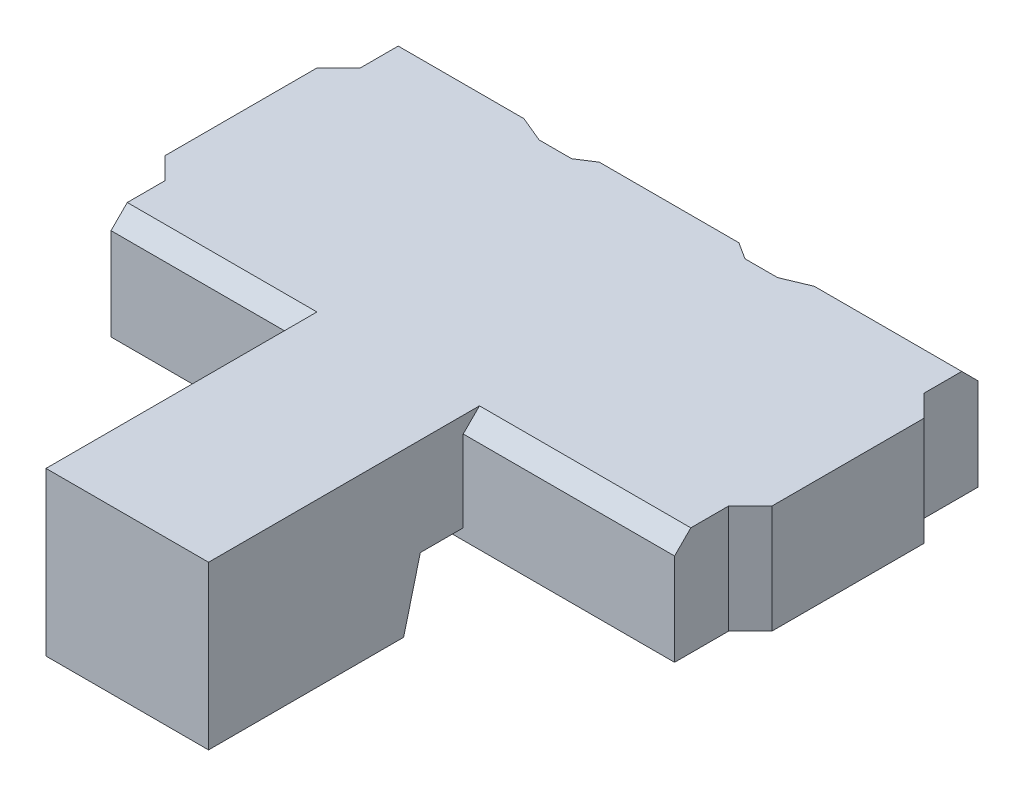
ISO-10303-21;
HEADER;
FILE_DESCRIPTION(('STEP AP214'),'2;1');
FILE_NAME('part.step','',(''),(''),'','','');
FILE_SCHEMA(('AUTOMOTIVE_DESIGN { 1 0 10303 214 1 1 1 1 }'));
ENDSEC;
DATA;
#1=APPLICATION_CONTEXT('core data for automotive mechanical design processes');
#2=APPLICATION_PROTOCOL_DEFINITION('international standard','automotive_design',2000,#1);
#3=PRODUCT_CONTEXT('',#1,'mechanical');
#4=PRODUCT('Part','Part','',(#3));
#5=PRODUCT_RELATED_PRODUCT_CATEGORY('part','',(#4));
#6=PRODUCT_DEFINITION_FORMATION('','',#4);
#7=PRODUCT_DEFINITION_CONTEXT('part definition',#1,'design');
#8=PRODUCT_DEFINITION('design','',#6,#7);
#9=PRODUCT_DEFINITION_SHAPE('','',#8);
#10=(LENGTH_UNIT() NAMED_UNIT(*) SI_UNIT(.MILLI.,.METRE.));
#11=(NAMED_UNIT(*) PLANE_ANGLE_UNIT() SI_UNIT($,.RADIAN.));
#12=(NAMED_UNIT(*) SI_UNIT($,.STERADIAN.) SOLID_ANGLE_UNIT());
#13=UNCERTAINTY_MEASURE_WITH_UNIT(LENGTH_MEASURE(1.E-05),#10,'distance_accuracy_value','');
#14=(GEOMETRIC_REPRESENTATION_CONTEXT(3) GLOBAL_UNCERTAINTY_ASSIGNED_CONTEXT((#13)) GLOBAL_UNIT_ASSIGNED_CONTEXT((#10,
#11,#12)) REPRESENTATION_CONTEXT('',''));
#15=CARTESIAN_POINT('',(0.,0.,0.));
#16=DIRECTION('',(0.,0.,1.));
#17=DIRECTION('',(1.,0.,0.));
#18=AXIS2_PLACEMENT_3D('',#15,#16,#17);
#19=CARTESIAN_POINT('',(-0.25,0.,0.));
#20=DIRECTION('',(1.,0.,0.));
#21=DIRECTION('',(0.,1.,0.));
#22=AXIS2_PLACEMENT_3D('',#19,#20,#21);
#23=PLANE('',#22);
#24=DIRECTION('',(0.,0.,-1.));
#25=VECTOR('',#24,1.);
#26=CARTESIAN_POINT('',(-0.25,-0.9,1.795946183779));
#27=LINE('',#26,#25);
#28=CARTESIAN_POINT('',(-0.25,-0.9,1.795946183779));
#29=VERTEX_POINT('',#28);
#30=CARTESIAN_POINT('',(-0.25,-0.9,1.4));
#31=VERTEX_POINT('',#30);
#32=EDGE_CURVE('E439',#29,#31,#27,.T.);
#33=ORIENTED_EDGE('',*,*,#32,.T.);
#34=DIRECTION('',(0.,1.,0.));
#35=VECTOR('',#34,1.);
#36=CARTESIAN_POINT('',(-0.25,-1.,1.4));
#37=LINE('',#36,#35);
#38=CARTESIAN_POINT('',(-0.25,-0.15,1.4));
#39=VERTEX_POINT('',#38);
#40=EDGE_CURVE('E395',#31,#39,#37,.T.);
#41=ORIENTED_EDGE('',*,*,#40,.T.);
#42=DIRECTION('',(0.,-0.707106781186548,0.707106781186548));
#43=VECTOR('',#42,1.);
#44=CARTESIAN_POINT('',(-0.25,0.,1.25));
#45=LINE('',#44,#43);
#46=CARTESIAN_POINT('',(-0.25,0.,1.25));
#47=VERTEX_POINT('',#46);
#48=EDGE_CURVE('E422',#47,#39,#45,.T.);
#49=ORIENTED_EDGE('',*,*,#48,.F.);
#50=DIRECTION('',(0.,0.,1.));
#51=VECTOR('',#50,1.);
#52=CARTESIAN_POINT('',(-0.25,0.,0.9));
#53=LINE('',#52,#51);
#54=CARTESIAN_POINT('',(-0.25,0.,3.75));
#55=VERTEX_POINT('',#54);
#56=EDGE_CURVE('E527',#47,#55,#53,.T.);
#57=ORIENTED_EDGE('',*,*,#56,.T.);
#58=DIRECTION('',(0.,-1.,0.));
#59=VECTOR('',#58,1.);
#60=CARTESIAN_POINT('',(-0.25,0.,3.75));
#61=LINE('',#60,#59);
#62=CARTESIAN_POINT('',(-0.25,-1.5,3.75));
#63=VERTEX_POINT('',#62);
#64=EDGE_CURVE('E328',#55,#63,#61,.T.);
#65=ORIENTED_EDGE('',*,*,#64,.T.);
#66=DIRECTION('',(0.,0.,-1.));
#67=VECTOR('',#66,1.);
#68=CARTESIAN_POINT('',(-0.25,-1.5,3.75));
#69=LINE('',#68,#67);
#70=CARTESIAN_POINT('',(-0.25,-1.5,1.95));
#71=VERTEX_POINT('',#70);
#72=EDGE_CURVE('E505',#63,#71,#69,.T.);
#73=ORIENTED_EDGE('',*,*,#72,.T.);
#74=DIRECTION('',(0.,0.968583161128619,-0.248689887164902));
#75=VECTOR('',#74,1.);
#76=CARTESIAN_POINT('',(-0.25,-1.5,1.95));
#77=LINE('',#76,#75);
#78=EDGE_CURVE('E317',#71,#29,#77,.T.);
#79=ORIENTED_EDGE('',*,*,#78,.T.);
#80=EDGE_LOOP('',(#33,#41,#49,#57,#65,#73,#79));
#81=FACE_BOUND('',#80,.T.);
#82=ADVANCED_FACE('F16',(#81),#23,.T.);
#83=CARTESIAN_POINT('',(-1.75,0.,0.));
#84=DIRECTION('',(1.,0.,0.));
#85=DIRECTION('',(0.,1.,0.));
#86=AXIS2_PLACEMENT_3D('',#83,#84,#85);
#87=PLANE('',#86);
#88=DIRECTION('',(0.,1.,0.));
#89=VECTOR('',#88,1.);
#90=CARTESIAN_POINT('',(-1.75,-1.,1.4));
#91=LINE('',#90,#89);
#92=CARTESIAN_POINT('',(-1.75,-0.9,1.4));
#93=VERTEX_POINT('',#92);
#94=CARTESIAN_POINT('',(-1.75,-0.15,1.4));
#95=VERTEX_POINT('',#94);
#96=EDGE_CURVE('E392',#93,#95,#91,.T.);
#97=ORIENTED_EDGE('',*,*,#96,.F.);
#98=DIRECTION('',(0.,0.,-1.));
#99=VECTOR('',#98,1.);
#100=CARTESIAN_POINT('',(-1.75,-0.9,1.795946183779));
#101=LINE('',#100,#99);
#102=CARTESIAN_POINT('',(-1.75,-0.9,1.795946183779));
#103=VERTEX_POINT('',#102);
#104=EDGE_CURVE('E434',#103,#93,#101,.T.);
#105=ORIENTED_EDGE('',*,*,#104,.F.);
#106=DIRECTION('',(0.,0.968583161128619,-0.248689887164902));
#107=VECTOR('',#106,1.);
#108=CARTESIAN_POINT('',(-1.75,-1.5,1.95));
#109=LINE('',#108,#107);
#110=CARTESIAN_POINT('',(-1.75,-1.5,1.95));
#111=VERTEX_POINT('',#110);
#112=EDGE_CURVE('E578',#111,#103,#109,.T.);
#113=ORIENTED_EDGE('',*,*,#112,.F.);
#114=DIRECTION('',(0.,0.,-1.));
#115=VECTOR('',#114,1.);
#116=CARTESIAN_POINT('',(-1.75,-1.5,3.75));
#117=LINE('',#116,#115);
#118=CARTESIAN_POINT('',(-1.75,-1.5,3.75));
#119=VERTEX_POINT('',#118);
#120=EDGE_CURVE('E438',#119,#111,#117,.T.);
#121=ORIENTED_EDGE('',*,*,#120,.F.);
#122=DIRECTION('',(0.,-1.,0.));
#123=VECTOR('',#122,1.);
#124=CARTESIAN_POINT('',(-1.75,0.,3.75));
#125=LINE('',#124,#123);
#126=CARTESIAN_POINT('',(-1.75,0.,3.75));
#127=VERTEX_POINT('',#126);
#128=EDGE_CURVE('E324',#127,#119,#125,.T.);
#129=ORIENTED_EDGE('',*,*,#128,.F.);
#130=DIRECTION('',(0.,0.,1.));
#131=VECTOR('',#130,1.);
#132=CARTESIAN_POINT('',(-1.75,0.,0.9));
#133=LINE('',#132,#131);
#134=CARTESIAN_POINT('',(-1.75,0.,1.25));
#135=VERTEX_POINT('',#134);
#136=EDGE_CURVE('E330',#135,#127,#133,.T.);
#137=ORIENTED_EDGE('',*,*,#136,.F.);
#138=DIRECTION('',(0.,-0.707106781186548,0.707106781186548));
#139=VECTOR('',#138,1.);
#140=CARTESIAN_POINT('',(-1.75,0.,1.25));
#141=LINE('',#140,#139);
#142=EDGE_CURVE('E485',#135,#95,#141,.T.);
#143=ORIENTED_EDGE('',*,*,#142,.T.);
#144=EDGE_LOOP('',(#97,#105,#113,#121,#129,#137,#143));
#145=FACE_BOUND('',#144,.T.);
#146=ADVANCED_FACE('F695',(#145),#87,.F.);
#147=CARTESIAN_POINT('',(1.9,-1.,-0.7));
#148=DIRECTION('',(0.707106781186548,0.,-0.707106781186548));
#149=DIRECTION('',(0.,-1.,0.));
#150=AXIS2_PLACEMENT_3D('',#147,#148,#149);
#151=PLANE('',#150);
#152=DIRECTION('',(-0.707106781186548,0.,-0.707106781186548));
#153=VECTOR('',#152,1.);
#154=CARTESIAN_POINT('',(1.9,0.,-0.7));
#155=LINE('',#154,#153);
#156=CARTESIAN_POINT('',(1.9,0.,-0.7));
#157=VERTEX_POINT('',#156);
#158=CARTESIAN_POINT('',(1.7,0.,-0.9));
#159=VERTEX_POINT('',#158);
#160=EDGE_CURVE('E306',#157,#159,#155,.T.);
#161=ORIENTED_EDGE('',*,*,#160,.F.);
#162=DIRECTION('',(0.,1.,0.));
#163=VECTOR('',#162,1.);
#164=CARTESIAN_POINT('',(1.9,-1.,-0.7));
#165=LINE('',#164,#163);
#166=CARTESIAN_POINT('',(1.9,-1.,-0.7));
#167=VERTEX_POINT('',#166);
#168=EDGE_CURVE('E445',#167,#157,#165,.T.);
#169=ORIENTED_EDGE('',*,*,#168,.F.);
#170=DIRECTION('',(-0.707106781186548,0.,-0.707106781186548));
#171=VECTOR('',#170,1.);
#172=CARTESIAN_POINT('',(1.9,-1.,-0.7));
#173=LINE('',#172,#171);
#174=CARTESIAN_POINT('',(1.7,-1.,-0.9));
#175=VERTEX_POINT('',#174);
#176=EDGE_CURVE('E426',#167,#175,#173,.T.);
#177=ORIENTED_EDGE('',*,*,#176,.T.);
#178=DIRECTION('',(0.,1.,0.));
#179=VECTOR('',#178,1.);
#180=CARTESIAN_POINT('',(1.7,-1.,-0.9));
#181=LINE('',#180,#179);
#182=EDGE_CURVE('E11',#175,#159,#181,.T.);
#183=ORIENTED_EDGE('',*,*,#182,.T.);
#184=EDGE_LOOP('',(#161,#169,#177,#183));
#185=FACE_BOUND('',#184,.T.);
#186=ADVANCED_FACE('F1129',(#185),#151,.T.);
#187=CARTESIAN_POINT('',(1.7,-1.,-0.9));
#188=DIRECTION('',(1.,0.,0.));
#189=DIRECTION('',(0.,1.,0.));
#190=AXIS2_PLACEMENT_3D('',#187,#188,#189);
#191=PLANE('',#190);
#192=DIRECTION('',(0.,-0.707106781186548,-0.707106781186548));
#193=VECTOR('',#192,1.);
#194=CARTESIAN_POINT('',(1.7,-0.325,-1.575));
#195=LINE('',#194,#193);
#196=CARTESIAN_POINT('',(1.7,0.,-1.25));
#197=VERTEX_POINT('',#196);
#198=CARTESIAN_POINT('',(1.7,-0.15,-1.4));
#199=VERTEX_POINT('',#198);
#200=EDGE_CURVE('E352',#197,#199,#195,.T.);
#201=ORIENTED_EDGE('',*,*,#200,.F.);
#202=DIRECTION('',(0.,0.,-1.));
#203=VECTOR('',#202,1.);
#204=CARTESIAN_POINT('',(1.7,0.,-0.9));
#205=LINE('',#204,#203);
#206=EDGE_CURVE('E300',#159,#197,#205,.T.);
#207=ORIENTED_EDGE('',*,*,#206,.F.);
#208=ORIENTED_EDGE('',*,*,#182,.F.);
#209=DIRECTION('',(0.,0.,-1.));
#210=VECTOR('',#209,1.);
#211=CARTESIAN_POINT('',(1.7,-1.,-0.9));
#212=LINE('',#211,#210);
#213=CARTESIAN_POINT('',(1.7,-1.,-1.4));
#214=VERTEX_POINT('',#213);
#215=EDGE_CURVE('E377',#175,#214,#212,.T.);
#216=ORIENTED_EDGE('',*,*,#215,.T.);
#217=DIRECTION('',(0.,1.,0.));
#218=VECTOR('',#217,1.);
#219=CARTESIAN_POINT('',(1.7,-1.,-1.4));
#220=LINE('',#219,#218);
#221=EDGE_CURVE('E27',#214,#199,#220,.T.);
#222=ORIENTED_EDGE('',*,*,#221,.T.);
#223=EDGE_LOOP('',(#201,#207,#208,#216,#222));
#224=FACE_BOUND('',#223,.T.);
#225=ADVANCED_FACE('F1124',(#224),#191,.T.);
#226=CARTESIAN_POINT('',(1.7,-1.,-1.4));
#227=DIRECTION('',(0.,0.,-1.));
#228=DIRECTION('',(0.,-1.,0.));
#229=AXIS2_PLACEMENT_3D('',#226,#227,#228);
#230=PLANE('',#229);
#231=DIRECTION('',(-1.,0.,0.));
#232=VECTOR('',#231,1.);
#233=CARTESIAN_POINT('',(5.,-0.15,-1.4));
#234=LINE('',#233,#232);
#235=CARTESIAN_POINT('',(0.7,-0.15,-1.4));
#236=VERTEX_POINT('',#235);
#237=EDGE_CURVE('E356',#199,#236,#234,.T.);
#238=ORIENTED_EDGE('',*,*,#237,.F.);
#239=ORIENTED_EDGE('',*,*,#221,.F.);
#240=DIRECTION('',(-1.,0.,0.));
#241=VECTOR('',#240,1.);
#242=CARTESIAN_POINT('',(1.7,-1.,-1.4));
#243=LINE('',#242,#241);
#244=CARTESIAN_POINT('',(0.7,-1.,-1.4));
#245=VERTEX_POINT('',#244);
#246=EDGE_CURVE('E373',#214,#245,#243,.T.);
#247=ORIENTED_EDGE('',*,*,#246,.T.);
#248=DIRECTION('',(0.,1.,0.));
#249=VECTOR('',#248,1.);
#250=CARTESIAN_POINT('',(0.7,-1.,-1.4));
#251=LINE('',#250,#249);
#252=EDGE_CURVE('E284',#245,#236,#251,.T.);
#253=ORIENTED_EDGE('',*,*,#252,.T.);
#254=EDGE_LOOP('',(#238,#239,#247,#253));
#255=FACE_BOUND('',#254,.T.);
#256=ADVANCED_FACE('F1053',(#255),#230,.T.);
#257=CARTESIAN_POINT('',(0.7,-1.,-1.4));
#258=DIRECTION('',(-0.38461538461503,0.,-0.923076923077071));
#259=DIRECTION('',(-0.923076923077071,0.,0.38461538461503));
#260=AXIS2_PLACEMENT_3D('',#257,#258,#259);
#261=PLANE('',#260);
#262=DIRECTION('',(-0.861549790341131,0.358979079309055,0.358979079309055));
#263=VECTOR('',#262,1.);
#264=CARTESIAN_POINT('',(0.962886597938,-0.259536082474,-1.509536082474));
#265=LINE('',#264,#263);
#266=CARTESIAN_POINT('',(0.34,0.,-1.25));
#267=VERTEX_POINT('',#266);
#268=EDGE_CURVE('E413',#236,#267,#265,.T.);
#269=ORIENTED_EDGE('',*,*,#268,.F.);
#270=ORIENTED_EDGE('',*,*,#252,.F.);
#271=DIRECTION('',(-0.923076923077071,0.,0.38461538461503));
#272=VECTOR('',#271,1.);
#273=CARTESIAN_POINT('',(0.7,-1.,-1.4));
#274=LINE('',#273,#272);
#275=CARTESIAN_POINT('',(0.1,-1.,-1.15));
#276=VERTEX_POINT('',#275);
#277=EDGE_CURVE('E279',#245,#276,#274,.T.);
#278=ORIENTED_EDGE('',*,*,#277,.T.);
#279=DIRECTION('',(0.,1.,0.));
#280=VECTOR('',#279,1.);
#281=CARTESIAN_POINT('',(0.1,-1.,-1.15));
#282=LINE('',#281,#280);
#283=CARTESIAN_POINT('',(0.1,0.,-1.15));
#284=VERTEX_POINT('',#283);
#285=EDGE_CURVE('E271',#276,#284,#282,.T.);
#286=ORIENTED_EDGE('',*,*,#285,.T.);
#287=DIRECTION('',(-0.923076923077071,0.,0.38461538461503));
#288=VECTOR('',#287,1.);
#289=CARTESIAN_POINT('',(0.7,0.,-1.4));
#290=LINE('',#289,#288);
#291=EDGE_CURVE('E276',#267,#284,#290,.T.);
#292=ORIENTED_EDGE('',*,*,#291,.F.);
#293=EDGE_LOOP('',(#269,#270,#278,#286,#292));
#294=FACE_BOUND('',#293,.T.);
#295=ADVANCED_FACE('F274',(#294),#261,.T.);
#296=CARTESIAN_POINT('',(0.1,-1.,-1.15));
#297=DIRECTION('',(0.,0.,-1.));
#298=DIRECTION('',(0.,-1.,0.));
#299=AXIS2_PLACEMENT_3D('',#296,#297,#298);
#300=PLANE('',#299);
#301=DIRECTION('',(-1.,0.,0.));
#302=VECTOR('',#301,1.);
#303=CARTESIAN_POINT('',(0.1,0.,-1.15));
#304=LINE('',#303,#302);
#305=CARTESIAN_POINT('',(-0.2,0.,-1.15));
#306=VERTEX_POINT('',#305);
#307=EDGE_CURVE('E288',#284,#306,#304,.T.);
#308=ORIENTED_EDGE('',*,*,#307,.F.);
#309=ORIENTED_EDGE('',*,*,#285,.F.);
#310=DIRECTION('',(-1.,0.,0.));
#311=VECTOR('',#310,1.);
#312=CARTESIAN_POINT('',(0.1,-1.,-1.15));
#313=LINE('',#312,#311);
#314=CARTESIAN_POINT('',(-0.2,-1.,-1.15));
#315=VERTEX_POINT('',#314);
#316=EDGE_CURVE('E369',#276,#315,#313,.T.);
#317=ORIENTED_EDGE('',*,*,#316,.T.);
#318=DIRECTION('',(0.,1.,0.));
#319=VECTOR('',#318,1.);
#320=CARTESIAN_POINT('',(-0.2,-1.,-1.15));
#321=LINE('',#320,#319);
#322=EDGE_CURVE('E285',#315,#306,#321,.T.);
#323=ORIENTED_EDGE('',*,*,#322,.T.);
#324=EDGE_LOOP('',(#308,#309,#317,#323));
#325=FACE_BOUND('',#324,.T.);
#326=ADVANCED_FACE('F289',(#325),#300,.T.);
#327=CARTESIAN_POINT('',(-0.2,-1.,-1.15));
#328=DIRECTION('',(0.538686775746896,0.,-0.842506117268838));
#329=DIRECTION('',(0.,-1.,0.));
#330=AXIS2_PLACEMENT_3D('',#327,#328,#329);
#331=PLANE('',#330);
#332=DIRECTION('',(-0.741732537970153,-0.474253540902098,-0.474253540902098));
#333=VECTOR('',#332,1.);
#334=CARTESIAN_POINT('',(-0.586946210788,-0.147408063164,-1.397408063164));
#335=LINE('',#334,#333);
#336=CARTESIAN_POINT('',(-0.3564,0.,-1.25));
#337=VERTEX_POINT('',#336);
#338=CARTESIAN_POINT('',(-0.591,-0.15,-1.4));
#339=VERTEX_POINT('',#338);
#340=EDGE_CURVE('E350',#337,#339,#335,.T.);
#341=ORIENTED_EDGE('',*,*,#340,.F.);
#342=DIRECTION('',(-0.842506117268838,0.,-0.538686775746896));
#343=VECTOR('',#342,1.);
#344=CARTESIAN_POINT('',(-0.2,0.,-1.15));
#345=LINE('',#344,#343);
#346=EDGE_CURVE('E293',#306,#337,#345,.T.);
#347=ORIENTED_EDGE('',*,*,#346,.F.);
#348=ORIENTED_EDGE('',*,*,#322,.F.);
#349=DIRECTION('',(-0.842506117268838,0.,-0.538686775746896));
#350=VECTOR('',#349,1.);
#351=CARTESIAN_POINT('',(-0.2,-1.,-1.15));
#352=LINE('',#351,#350);
#353=CARTESIAN_POINT('',(-0.591,-1.,-1.4));
#354=VERTEX_POINT('',#353);
#355=EDGE_CURVE('E372',#315,#354,#352,.T.);
#356=ORIENTED_EDGE('',*,*,#355,.T.);
#357=DIRECTION('',(0.,1.,0.));
#358=VECTOR('',#357,1.);
#359=CARTESIAN_POINT('',(-0.591,-1.,-1.4));
#360=LINE('',#359,#358);
#361=EDGE_CURVE('E390',#354,#339,#360,.T.);
#362=ORIENTED_EDGE('',*,*,#361,.T.);
#363=EDGE_LOOP('',(#341,#347,#348,#356,#362));
#364=FACE_BOUND('',#363,.T.);
#365=ADVANCED_FACE('F650',(#364),#331,.T.);
#366=CARTESIAN_POINT('',(-0.591,-1.,-1.4));
#367=DIRECTION('',(0.,0.,-1.));
#368=DIRECTION('',(0.,-1.,0.));
#369=AXIS2_PLACEMENT_3D('',#366,#367,#368);
#370=PLANE('',#369);
#371=DIRECTION('',(-1.,0.,0.));
#372=VECTOR('',#371,1.);
#373=CARTESIAN_POINT('',(5.,-0.15,-1.4));
#374=LINE('',#373,#372);
#375=CARTESIAN_POINT('',(-1.409,-0.15,-1.4));
#376=VERTEX_POINT('',#375);
#377=EDGE_CURVE('E509',#339,#376,#374,.T.);
#378=ORIENTED_EDGE('',*,*,#377,.F.);
#379=ORIENTED_EDGE('',*,*,#361,.F.);
#380=DIRECTION('',(-1.,0.,0.));
#381=VECTOR('',#380,1.);
#382=CARTESIAN_POINT('',(-0.591,-1.,-1.4));
#383=LINE('',#382,#381);
#384=CARTESIAN_POINT('',(-1.409,-1.,-1.4));
#385=VERTEX_POINT('',#384);
#386=EDGE_CURVE('E344',#354,#385,#383,.T.);
#387=ORIENTED_EDGE('',*,*,#386,.T.);
#388=DIRECTION('',(0.,1.,0.));
#389=VECTOR('',#388,1.);
#390=CARTESIAN_POINT('',(-1.409,-1.,-1.4));
#391=LINE('',#390,#389);
#392=EDGE_CURVE('E387',#385,#376,#391,.T.);
#393=ORIENTED_EDGE('',*,*,#392,.T.);
#394=EDGE_LOOP('',(#378,#379,#387,#393));
#395=FACE_BOUND('',#394,.T.);
#396=ADVANCED_FACE('F654',(#395),#370,.T.);
#397=CARTESIAN_POINT('',(-1.409,-1.,-1.4));
#398=DIRECTION('',(-0.538686775746896,0.,-0.842506117268838));
#399=DIRECTION('',(-0.842506117268838,0.,0.538686775746896));
#400=AXIS2_PLACEMENT_3D('',#397,#398,#399);
#401=PLANE('',#400);
#402=DIRECTION('',(-0.741732537970153,0.474253540902098,0.474253540902098));
#403=VECTOR('',#402,1.);
#404=CARTESIAN_POINT('',(-1.109996109846,-0.341178957899,-1.591178957899));
#405=LINE('',#404,#403);
#406=CARTESIAN_POINT('',(-1.6436,0.,-1.25));
#407=VERTEX_POINT('',#406);
#408=EDGE_CURVE('E593',#376,#407,#405,.T.);
#409=ORIENTED_EDGE('',*,*,#408,.F.);
#410=ORIENTED_EDGE('',*,*,#392,.F.);
#411=DIRECTION('',(-0.842506117268838,0.,0.538686775746896));
#412=VECTOR('',#411,1.);
#413=CARTESIAN_POINT('',(-1.409,-1.,-1.4));
#414=LINE('',#413,#412);
#415=CARTESIAN_POINT('',(-1.8,-1.,-1.15));
#416=VERTEX_POINT('',#415);
#417=EDGE_CURVE('E340',#385,#416,#414,.T.);
#418=ORIENTED_EDGE('',*,*,#417,.T.);
#419=DIRECTION('',(0.,1.,0.));
#420=VECTOR('',#419,1.);
#421=CARTESIAN_POINT('',(-1.8,-1.,-1.15));
#422=LINE('',#421,#420);
#423=CARTESIAN_POINT('',(-1.8,0.,-1.15));
#424=VERTEX_POINT('',#423);
#425=EDGE_CURVE('E391',#416,#424,#422,.T.);
#426=ORIENTED_EDGE('',*,*,#425,.T.);
#427=DIRECTION('',(-0.842506117268838,0.,0.538686775746896));
#428=VECTOR('',#427,1.);
#429=CARTESIAN_POINT('',(-1.409,0.,-1.4));
#430=LINE('',#429,#428);
#431=EDGE_CURVE('E537',#407,#424,#430,.T.);
#432=ORIENTED_EDGE('',*,*,#431,.F.);
#433=EDGE_LOOP('',(#409,#410,#418,#426,#432));
#434=FACE_BOUND('',#433,.T.);
#435=ADVANCED_FACE('F647',(#434),#401,.T.);
#436=CARTESIAN_POINT('',(-1.8,-1.,-1.15));
#437=DIRECTION('',(0.,0.,-1.));
#438=DIRECTION('',(0.,-1.,0.));
#439=AXIS2_PLACEMENT_3D('',#436,#437,#438);
#440=PLANE('',#439);
#441=DIRECTION('',(-1.,0.,0.));
#442=VECTOR('',#441,1.);
#443=CARTESIAN_POINT('',(-1.8,0.,-1.15));
#444=LINE('',#443,#442);
#445=CARTESIAN_POINT('',(-2.1,0.,-1.15));
#446=VERTEX_POINT('',#445);
#447=EDGE_CURVE('E382',#424,#446,#444,.T.);
#448=ORIENTED_EDGE('',*,*,#447,.F.);
#449=ORIENTED_EDGE('',*,*,#425,.F.);
#450=DIRECTION('',(-1.,0.,0.));
#451=VECTOR('',#450,1.);
#452=CARTESIAN_POINT('',(-1.8,-1.,-1.15));
#453=LINE('',#452,#451);
#454=CARTESIAN_POINT('',(-2.1,-1.,-1.15));
#455=VERTEX_POINT('',#454);
#456=EDGE_CURVE('E345',#416,#455,#453,.T.);
#457=ORIENTED_EDGE('',*,*,#456,.T.);
#458=DIRECTION('',(0.,1.,0.));
#459=VECTOR('',#458,1.);
#460=CARTESIAN_POINT('',(-2.1,-1.,-1.15));
#461=LINE('',#460,#459);
#462=EDGE_CURVE('E442',#455,#446,#461,.T.);
#463=ORIENTED_EDGE('',*,*,#462,.T.);
#464=EDGE_LOOP('',(#448,#449,#457,#463));
#465=FACE_BOUND('',#464,.T.);
#466=ADVANCED_FACE('F660',(#465),#440,.T.);
#467=CARTESIAN_POINT('',(-2.1,-1.,-1.15));
#468=DIRECTION('',(0.38461538461503,0.,-0.923076923077071));
#469=DIRECTION('',(0.,-1.,0.));
#470=AXIS2_PLACEMENT_3D('',#467,#468,#469);
#471=PLANE('',#470);
#472=DIRECTION('',(-0.861549790341131,-0.358979079309055,-0.358979079309055));
#473=VECTOR('',#472,1.);
#474=CARTESIAN_POINT('',(-2.440206185567,-0.04175257731959,-1.29175257732));
#475=LINE('',#474,#473);
#476=CARTESIAN_POINT('',(-2.34,0.,-1.25));
#477=VERTEX_POINT('',#476);
#478=CARTESIAN_POINT('',(-2.7,-0.15,-1.4));
#479=VERTEX_POINT('',#478);
#480=EDGE_CURVE('E466',#477,#479,#475,.T.);
#481=ORIENTED_EDGE('',*,*,#480,.F.);
#482=DIRECTION('',(-0.923076923077071,0.,-0.38461538461503));
#483=VECTOR('',#482,1.);
#484=CARTESIAN_POINT('',(-2.1,0.,-1.15));
#485=LINE('',#484,#483);
#486=EDGE_CURVE('E378',#446,#477,#485,.T.);
#487=ORIENTED_EDGE('',*,*,#486,.F.);
#488=ORIENTED_EDGE('',*,*,#462,.F.);
#489=DIRECTION('',(-0.923076923077071,0.,-0.38461538461503));
#490=VECTOR('',#489,1.);
#491=CARTESIAN_POINT('',(-2.1,-1.,-1.15));
#492=LINE('',#491,#490);
#493=CARTESIAN_POINT('',(-2.7,-1.,-1.4));
#494=VERTEX_POINT('',#493);
#495=EDGE_CURVE('E406',#455,#494,#492,.T.);
#496=ORIENTED_EDGE('',*,*,#495,.T.);
#497=DIRECTION('',(0.,1.,0.));
#498=VECTOR('',#497,1.);
#499=CARTESIAN_POINT('',(-2.7,-1.,-1.4));
#500=LINE('',#499,#498);
#501=EDGE_CURVE('E20',#494,#479,#500,.T.);
#502=ORIENTED_EDGE('',*,*,#501,.T.);
#503=EDGE_LOOP('',(#481,#487,#488,#496,#502));
#504=FACE_BOUND('',#503,.T.);
#505=ADVANCED_FACE('F668',(#504),#471,.T.);
#506=CARTESIAN_POINT('',(-2.7,-1.,-1.4));
#507=DIRECTION('',(0.,0.,-1.));
#508=DIRECTION('',(0.,-1.,0.));
#509=AXIS2_PLACEMENT_3D('',#506,#507,#508);
#510=PLANE('',#509);
#511=DIRECTION('',(-1.,0.,0.));
#512=VECTOR('',#511,1.);
#513=CARTESIAN_POINT('',(5.,-0.15,-1.4));
#514=LINE('',#513,#512);
#515=CARTESIAN_POINT('',(-3.5,-0.15,-1.4));
#516=VERTEX_POINT('',#515);
#517=EDGE_CURVE('E462',#479,#516,#514,.T.);
#518=ORIENTED_EDGE('',*,*,#517,.F.);
#519=ORIENTED_EDGE('',*,*,#501,.F.);
#520=DIRECTION('',(-1.,0.,0.));
#521=VECTOR('',#520,1.);
#522=CARTESIAN_POINT('',(-2.7,-1.,-1.4));
#523=LINE('',#522,#521);
#524=CARTESIAN_POINT('',(-3.5,-1.,-1.4));
#525=VERTEX_POINT('',#524);
#526=EDGE_CURVE('E360',#494,#525,#523,.T.);
#527=ORIENTED_EDGE('',*,*,#526,.T.);
#528=DIRECTION('',(0.,1.,0.));
#529=VECTOR('',#528,1.);
#530=CARTESIAN_POINT('',(-3.5,-1.,-1.4));
#531=LINE('',#530,#529);
#532=EDGE_CURVE('E361',#525,#516,#531,.T.);
#533=ORIENTED_EDGE('',*,*,#532,.T.);
#534=EDGE_LOOP('',(#518,#519,#527,#533));
#535=FACE_BOUND('',#534,.T.);
#536=ADVANCED_FACE('F673',(#535),#510,.T.);
#537=CARTESIAN_POINT('',(0.,-1.,0.));
#538=DIRECTION('',(0.,1.,0.));
#539=DIRECTION('',(1.,0.,0.));
#540=AXIS2_PLACEMENT_3D('',#537,#538,#539);
#541=PLANE('',#540);
#542=DIRECTION('',(-0.707106781186548,0.,0.707106781186548));
#543=VECTOR('',#542,1.);
#544=CARTESIAN_POINT('',(-3.5,-1.,-0.9));
#545=LINE('',#544,#543);
#546=CARTESIAN_POINT('',(-3.5,-1.,-0.9));
#547=VERTEX_POINT('',#546);
#548=CARTESIAN_POINT('',(-3.7,-1.,-0.7));
#549=VERTEX_POINT('',#548);
#550=EDGE_CURVE('E322',#547,#549,#545,.T.);
#551=ORIENTED_EDGE('',*,*,#550,.F.);
#552=DIRECTION('',(0.,0.,1.));
#553=VECTOR('',#552,1.);
#554=CARTESIAN_POINT('',(-3.5,-1.,-1.4));
#555=LINE('',#554,#553);
#556=EDGE_CURVE('E358',#525,#547,#555,.T.);
#557=ORIENTED_EDGE('',*,*,#556,.F.);
#558=ORIENTED_EDGE('',*,*,#526,.F.);
#559=ORIENTED_EDGE('',*,*,#495,.F.);
#560=ORIENTED_EDGE('',*,*,#456,.F.);
#561=ORIENTED_EDGE('',*,*,#417,.F.);
#562=ORIENTED_EDGE('',*,*,#386,.F.);
#563=ORIENTED_EDGE('',*,*,#355,.F.);
#564=ORIENTED_EDGE('',*,*,#316,.F.);
#565=ORIENTED_EDGE('',*,*,#277,.F.);
#566=ORIENTED_EDGE('',*,*,#246,.F.);
#567=ORIENTED_EDGE('',*,*,#215,.F.);
#568=ORIENTED_EDGE('',*,*,#176,.F.);
#569=DIRECTION('',(0.,0.,-1.));
#570=VECTOR('',#569,1.);
#571=CARTESIAN_POINT('',(1.9,-1.,0.7));
#572=LINE('',#571,#570);
#573=CARTESIAN_POINT('',(1.9,-1.,0.7));
#574=VERTEX_POINT('',#573);
#575=EDGE_CURVE('E449',#574,#167,#572,.T.);
#576=ORIENTED_EDGE('',*,*,#575,.F.);
#577=DIRECTION('',(0.707106781186548,0.,-0.707106781186548));
#578=VECTOR('',#577,1.);
#579=CARTESIAN_POINT('',(1.7,-1.,0.9));
#580=LINE('',#579,#578);
#581=CARTESIAN_POINT('',(1.7,-1.,0.9));
#582=VERTEX_POINT('',#581);
#583=EDGE_CURVE('E532',#582,#574,#580,.T.);
#584=ORIENTED_EDGE('',*,*,#583,.F.);
#585=DIRECTION('',(0.,0.,-1.));
#586=VECTOR('',#585,1.);
#587=CARTESIAN_POINT('',(1.7,-1.,1.4));
#588=LINE('',#587,#586);
#589=CARTESIAN_POINT('',(1.7,-1.,1.4));
#590=VERTEX_POINT('',#589);
#591=EDGE_CURVE('E494',#590,#582,#588,.T.);
#592=ORIENTED_EDGE('',*,*,#591,.F.);
#593=DIRECTION('',(1.,0.,0.));
#594=VECTOR('',#593,1.);
#595=CARTESIAN_POINT('',(-3.5,-1.,1.4));
#596=LINE('',#595,#594);
#597=CARTESIAN_POINT('',(-3.5,-1.,1.4));
#598=VERTEX_POINT('',#597);
#599=EDGE_CURVE('E365',#598,#590,#596,.T.);
#600=ORIENTED_EDGE('',*,*,#599,.F.);
#601=DIRECTION('',(0.,0.,1.));
#602=VECTOR('',#601,1.);
#603=CARTESIAN_POINT('',(-3.5,-1.,0.9));
#604=LINE('',#603,#602);
#605=CARTESIAN_POINT('',(-3.5,-1.,0.9));
#606=VERTEX_POINT('',#605);
#607=EDGE_CURVE('E335',#606,#598,#604,.T.);
#608=ORIENTED_EDGE('',*,*,#607,.F.);
#609=DIRECTION('',(0.707106781186548,0.,0.707106781186548));
#610=VECTOR('',#609,1.);
#611=CARTESIAN_POINT('',(-3.7,-1.,0.7));
#612=LINE('',#611,#610);
#613=CARTESIAN_POINT('',(-3.7,-1.,0.7));
#614=VERTEX_POINT('',#613);
#615=EDGE_CURVE('E383',#614,#606,#612,.T.);
#616=ORIENTED_EDGE('',*,*,#615,.F.);
#617=DIRECTION('',(0.,0.,1.));
#618=VECTOR('',#617,1.);
#619=CARTESIAN_POINT('',(-3.7,-1.,-0.7));
#620=LINE('',#619,#618);
#621=EDGE_CURVE('E386',#549,#614,#620,.T.);
#622=ORIENTED_EDGE('',*,*,#621,.F.);
#623=EDGE_LOOP('',(#551,#557,#558,#559,#560,#561,#562,#563,#564,#565,#566,#567,#568,#576,#584,
#592,#600,#608,#616,#622));
#624=FACE_BOUND('',#623,.T.);
#625=ADVANCED_FACE('F563',(#624),#541,.F.);
#626=CARTESIAN_POINT('',(-3.5,-1.,-1.4));
#627=DIRECTION('',(-1.,0.,0.));
#628=DIRECTION('',(0.,0.,1.));
#629=AXIS2_PLACEMENT_3D('',#626,#627,#628);
#630=PLANE('',#629);
#631=DIRECTION('',(0.,0.707106781186548,0.707106781186548));
#632=VECTOR('',#631,1.);
#633=CARTESIAN_POINT('',(-3.5,-0.575,-1.825));
#634=LINE('',#633,#632);
#635=CARTESIAN_POINT('',(-3.5,0.,-1.25));
#636=VERTEX_POINT('',#635);
#637=EDGE_CURVE('E351',#516,#636,#634,.T.);
#638=ORIENTED_EDGE('',*,*,#637,.F.);
#639=ORIENTED_EDGE('',*,*,#532,.F.);
#640=ORIENTED_EDGE('',*,*,#556,.T.);
#641=DIRECTION('',(0.,1.,0.));
#642=VECTOR('',#641,1.);
#643=CARTESIAN_POINT('',(-3.5,-1.,-0.9));
#644=LINE('',#643,#642);
#645=CARTESIAN_POINT('',(-3.5,0.,-0.9));
#646=VERTEX_POINT('',#645);
#647=EDGE_CURVE('E318',#547,#646,#644,.T.);
#648=ORIENTED_EDGE('',*,*,#647,.T.);
#649=DIRECTION('',(0.,0.,1.));
#650=VECTOR('',#649,1.);
#651=CARTESIAN_POINT('',(-3.5,0.,-1.4));
#652=LINE('',#651,#650);
#653=EDGE_CURVE('E381',#636,#646,#652,.T.);
#654=ORIENTED_EDGE('',*,*,#653,.F.);
#655=EDGE_LOOP('',(#638,#639,#640,#648,#654));
#656=FACE_BOUND('',#655,.T.);
#657=ADVANCED_FACE('F677',(#656),#630,.T.);
#658=CARTESIAN_POINT('',(-3.7,-1.,-0.7));
#659=DIRECTION('',(-1.,0.,0.));
#660=DIRECTION('',(0.,0.,1.));
#661=AXIS2_PLACEMENT_3D('',#658,#659,#660);
#662=PLANE('',#661);
#663=DIRECTION('',(0.,0.,1.));
#664=VECTOR('',#663,1.);
#665=CARTESIAN_POINT('',(-3.7,0.,-0.7));
#666=LINE('',#665,#664);
#667=CARTESIAN_POINT('',(-3.7,0.,-0.7));
#668=VERTEX_POINT('',#667);
#669=CARTESIAN_POINT('',(-3.7,0.,0.7));
#670=VERTEX_POINT('',#669);
#671=EDGE_CURVE('E433',#668,#670,#666,.T.);
#672=ORIENTED_EDGE('',*,*,#671,.F.);
#673=DIRECTION('',(0.,1.,0.));
#674=VECTOR('',#673,1.);
#675=CARTESIAN_POINT('',(-3.7,-1.,-0.7));
#676=LINE('',#675,#674);
#677=EDGE_CURVE('E459',#549,#668,#676,.T.);
#678=ORIENTED_EDGE('',*,*,#677,.F.);
#679=ORIENTED_EDGE('',*,*,#621,.T.);
#680=DIRECTION('',(0.,1.,0.));
#681=VECTOR('',#680,1.);
#682=CARTESIAN_POINT('',(-3.7,-1.,0.7));
#683=LINE('',#682,#681);
#684=EDGE_CURVE('E338',#614,#670,#683,.T.);
#685=ORIENTED_EDGE('',*,*,#684,.T.);
#686=EDGE_LOOP('',(#672,#678,#679,#685));
#687=FACE_BOUND('',#686,.T.);
#688=ADVANCED_FACE('F557',(#687),#662,.T.);
#689=CARTESIAN_POINT('',(-3.7,-1.,0.7));
#690=DIRECTION('',(-0.707106781186548,0.,0.707106781186548));
#691=DIRECTION('',(0.,1.,0.));
#692=AXIS2_PLACEMENT_3D('',#689,#690,#691);
#693=PLANE('',#692);
#694=DIRECTION('',(0.707106781186548,0.,0.707106781186548));
#695=VECTOR('',#694,1.);
#696=CARTESIAN_POINT('',(-3.7,0.,0.7));
#697=LINE('',#696,#695);
#698=CARTESIAN_POINT('',(-3.5,0.,0.9));
#699=VERTEX_POINT('',#698);
#700=EDGE_CURVE('E429',#670,#699,#697,.T.);
#701=ORIENTED_EDGE('',*,*,#700,.F.);
#702=ORIENTED_EDGE('',*,*,#684,.F.);
#703=ORIENTED_EDGE('',*,*,#615,.T.);
#704=DIRECTION('',(0.,1.,0.));
#705=VECTOR('',#704,1.);
#706=CARTESIAN_POINT('',(-3.5,-1.,0.9));
#707=LINE('',#706,#705);
#708=EDGE_CURVE('E339',#606,#699,#707,.T.);
#709=ORIENTED_EDGE('',*,*,#708,.T.);
#710=EDGE_LOOP('',(#701,#702,#703,#709));
#711=FACE_BOUND('',#710,.T.);
#712=ADVANCED_FACE('F567',(#711),#693,.T.);
#713=CARTESIAN_POINT('',(-3.5,-1.,0.9));
#714=DIRECTION('',(-1.,0.,0.));
#715=DIRECTION('',(0.,0.,1.));
#716=AXIS2_PLACEMENT_3D('',#713,#714,#715);
#717=PLANE('',#716);
#718=DIRECTION('',(0.,-0.707106781186548,0.707106781186548));
#719=VECTOR('',#718,1.);
#720=CARTESIAN_POINT('',(-3.5,-0.325,1.575));
#721=LINE('',#720,#719);
#722=CARTESIAN_POINT('',(-3.5,0.,1.25));
#723=VERTEX_POINT('',#722);
#724=CARTESIAN_POINT('',(-3.5,-0.15,1.4));
#725=VERTEX_POINT('',#724);
#726=EDGE_CURVE('E544',#723,#725,#721,.T.);
#727=ORIENTED_EDGE('',*,*,#726,.F.);
#728=DIRECTION('',(0.,0.,1.));
#729=VECTOR('',#728,1.);
#730=CARTESIAN_POINT('',(-3.5,0.,0.9));
#731=LINE('',#730,#729);
#732=EDGE_CURVE('E334',#699,#723,#731,.T.);
#733=ORIENTED_EDGE('',*,*,#732,.F.);
#734=ORIENTED_EDGE('',*,*,#708,.F.);
#735=ORIENTED_EDGE('',*,*,#607,.T.);
#736=DIRECTION('',(0.,1.,0.));
#737=VECTOR('',#736,1.);
#738=CARTESIAN_POINT('',(-3.5,-1.,1.4));
#739=LINE('',#738,#737);
#740=EDGE_CURVE('E368',#598,#725,#739,.T.);
#741=ORIENTED_EDGE('',*,*,#740,.T.);
#742=EDGE_LOOP('',(#727,#733,#734,#735,#741));
#743=FACE_BOUND('',#742,.T.);
#744=ADVANCED_FACE('F1007',(#743),#717,.T.);
#745=CARTESIAN_POINT('',(-3.5,-1.,1.4));
#746=DIRECTION('',(0.,0.,1.));
#747=DIRECTION('',(1.,0.,0.));
#748=AXIS2_PLACEMENT_3D('',#745,#746,#747);
#749=PLANE('',#748);
#750=ORIENTED_EDGE('',*,*,#40,.F.);
#751=DIRECTION('',(-1.,0.,0.));
#752=VECTOR('',#751,1.);
#753=CARTESIAN_POINT('',(-3.5,-0.9,1.4));
#754=LINE('',#753,#752);
#755=EDGE_CURVE('E316',#31,#93,#754,.T.);
#756=ORIENTED_EDGE('',*,*,#755,.T.);
#757=ORIENTED_EDGE('',*,*,#96,.T.);
#758=DIRECTION('',(-1.,0.,0.));
#759=VECTOR('',#758,1.);
#760=CARTESIAN_POINT('',(5.,-0.15,1.4));
#761=LINE('',#760,#759);
#762=EDGE_CURVE('E417',#95,#725,#761,.T.);
#763=ORIENTED_EDGE('',*,*,#762,.T.);
#764=ORIENTED_EDGE('',*,*,#740,.F.);
#765=ORIENTED_EDGE('',*,*,#599,.T.);
#766=DIRECTION('',(0.,1.,0.));
#767=VECTOR('',#766,1.);
#768=CARTESIAN_POINT('',(1.7,-1.,1.4));
#769=LINE('',#768,#767);
#770=CARTESIAN_POINT('',(1.7,-0.15,1.4));
#771=VERTEX_POINT('',#770);
#772=EDGE_CURVE('E448',#590,#771,#769,.T.);
#773=ORIENTED_EDGE('',*,*,#772,.T.);
#774=DIRECTION('',(-1.,0.,0.));
#775=VECTOR('',#774,1.);
#776=CARTESIAN_POINT('',(5.,-0.15,1.4));
#777=LINE('',#776,#775);
#778=EDGE_CURVE('E418',#771,#39,#777,.T.);
#779=ORIENTED_EDGE('',*,*,#778,.T.);
#780=EDGE_LOOP('',(#750,#756,#757,#763,#764,#765,#773,#779));
#781=FACE_BOUND('',#780,.T.);
#782=ADVANCED_FACE('F708',(#781),#749,.T.);
#783=CARTESIAN_POINT('',(1.7,-1.,1.4));
#784=DIRECTION('',(1.,0.,0.));
#785=DIRECTION('',(0.,1.,0.));
#786=AXIS2_PLACEMENT_3D('',#783,#784,#785);
#787=PLANE('',#786);
#788=DIRECTION('',(0.,0.707106781186548,-0.707106781186548));
#789=VECTOR('',#788,1.);
#790=CARTESIAN_POINT('',(1.7,-0.575,1.825));
#791=LINE('',#790,#789);
#792=CARTESIAN_POINT('',(1.7,0.,1.25));
#793=VERTEX_POINT('',#792);
#794=EDGE_CURVE('E329',#771,#793,#791,.T.);
#795=ORIENTED_EDGE('',*,*,#794,.F.);
#796=ORIENTED_EDGE('',*,*,#772,.F.);
#797=ORIENTED_EDGE('',*,*,#591,.T.);
#798=DIRECTION('',(0.,1.,0.));
#799=VECTOR('',#798,1.);
#800=CARTESIAN_POINT('',(1.7,-1.,0.9));
#801=LINE('',#800,#799);
#802=CARTESIAN_POINT('',(1.7,0.,0.9));
#803=VERTEX_POINT('',#802);
#804=EDGE_CURVE('E333',#582,#803,#801,.T.);
#805=ORIENTED_EDGE('',*,*,#804,.T.);
#806=DIRECTION('',(0.,0.,-1.));
#807=VECTOR('',#806,1.);
#808=CARTESIAN_POINT('',(1.7,0.,1.4));
#809=LINE('',#808,#807);
#810=EDGE_CURVE('E310',#793,#803,#809,.T.);
#811=ORIENTED_EDGE('',*,*,#810,.F.);
#812=EDGE_LOOP('',(#795,#796,#797,#805,#811));
#813=FACE_BOUND('',#812,.T.);
#814=ADVANCED_FACE('F1041',(#813),#787,.T.);
#815=CARTESIAN_POINT('',(1.9,-1.,0.7));
#816=DIRECTION('',(1.,0.,0.));
#817=DIRECTION('',(0.,1.,0.));
#818=AXIS2_PLACEMENT_3D('',#815,#816,#817);
#819=PLANE('',#818);
#820=DIRECTION('',(0.,0.,-1.));
#821=VECTOR('',#820,1.);
#822=CARTESIAN_POINT('',(1.9,0.,0.7));
#823=LINE('',#822,#821);
#824=CARTESIAN_POINT('',(1.9,0.,0.7));
#825=VERTEX_POINT('',#824);
#826=EDGE_CURVE('E401',#825,#157,#823,.T.);
#827=ORIENTED_EDGE('',*,*,#826,.F.);
#828=DIRECTION('',(0.,1.,0.));
#829=VECTOR('',#828,1.);
#830=CARTESIAN_POINT('',(1.9,-1.,0.7));
#831=LINE('',#830,#829);
#832=EDGE_CURVE('E518',#574,#825,#831,.T.);
#833=ORIENTED_EDGE('',*,*,#832,.F.);
#834=ORIENTED_EDGE('',*,*,#575,.T.);
#835=ORIENTED_EDGE('',*,*,#168,.T.);
#836=EDGE_LOOP('',(#827,#833,#834,#835));
#837=FACE_BOUND('',#836,.T.);
#838=ADVANCED_FACE('F981',(#837),#819,.T.);
#839=CARTESIAN_POINT('',(1.7,-1.,0.9));
#840=DIRECTION('',(0.707106781186548,0.,0.707106781186548));
#841=DIRECTION('',(0.,-1.,0.));
#842=AXIS2_PLACEMENT_3D('',#839,#840,#841);
#843=PLANE('',#842);
#844=DIRECTION('',(0.707106781186548,0.,-0.707106781186548));
#845=VECTOR('',#844,1.);
#846=CARTESIAN_POINT('',(1.7,0.,0.9));
#847=LINE('',#846,#845);
#848=EDGE_CURVE('E398',#803,#825,#847,.T.);
#849=ORIENTED_EDGE('',*,*,#848,.F.);
#850=ORIENTED_EDGE('',*,*,#804,.F.);
#851=ORIENTED_EDGE('',*,*,#583,.T.);
#852=ORIENTED_EDGE('',*,*,#832,.T.);
#853=EDGE_LOOP('',(#849,#850,#851,#852));
#854=FACE_BOUND('',#853,.T.);
#855=ADVANCED_FACE('F975',(#854),#843,.T.);
#856=CARTESIAN_POINT('',(0.,0.,0.));
#857=DIRECTION('',(0.,1.,0.));
#858=DIRECTION('',(1.,0.,0.));
#859=AXIS2_PLACEMENT_3D('',#856,#857,#858);
#860=PLANE('',#859);
#861=ORIENTED_EDGE('',*,*,#56,.F.);
#862=DIRECTION('',(-1.,0.,0.));
#863=VECTOR('',#862,1.);
#864=CARTESIAN_POINT('',(0.,0.,1.25));
#865=LINE('',#864,#863);
#866=EDGE_CURVE('E455',#793,#47,#865,.T.);
#867=ORIENTED_EDGE('',*,*,#866,.F.);
#868=ORIENTED_EDGE('',*,*,#810,.T.);
#869=ORIENTED_EDGE('',*,*,#848,.T.);
#870=ORIENTED_EDGE('',*,*,#826,.T.);
#871=ORIENTED_EDGE('',*,*,#160,.T.);
#872=ORIENTED_EDGE('',*,*,#206,.T.);
#873=DIRECTION('',(1.,0.,0.));
#874=VECTOR('',#873,1.);
#875=CARTESIAN_POINT('',(0.,0.,-1.25));
#876=LINE('',#875,#874);
#877=EDGE_CURVE('E297',#267,#197,#876,.T.);
#878=ORIENTED_EDGE('',*,*,#877,.F.);
#879=ORIENTED_EDGE('',*,*,#291,.T.);
#880=ORIENTED_EDGE('',*,*,#307,.T.);
#881=ORIENTED_EDGE('',*,*,#346,.T.);
#882=DIRECTION('',(1.,0.,0.));
#883=VECTOR('',#882,1.);
#884=CARTESIAN_POINT('',(0.,0.,-1.25));
#885=LINE('',#884,#883);
#886=EDGE_CURVE('E357',#407,#337,#885,.T.);
#887=ORIENTED_EDGE('',*,*,#886,.F.);
#888=ORIENTED_EDGE('',*,*,#431,.T.);
#889=ORIENTED_EDGE('',*,*,#447,.T.);
#890=ORIENTED_EDGE('',*,*,#486,.T.);
#891=DIRECTION('',(1.,0.,0.));
#892=VECTOR('',#891,1.);
#893=CARTESIAN_POINT('',(0.,0.,-1.25));
#894=LINE('',#893,#892);
#895=EDGE_CURVE('E346',#636,#477,#894,.T.);
#896=ORIENTED_EDGE('',*,*,#895,.F.);
#897=ORIENTED_EDGE('',*,*,#653,.T.);
#898=DIRECTION('',(-0.707106781186548,0.,0.707106781186548));
#899=VECTOR('',#898,1.);
#900=CARTESIAN_POINT('',(-3.5,0.,-0.9));
#901=LINE('',#900,#899);
#902=EDGE_CURVE('E323',#646,#668,#901,.T.);
#903=ORIENTED_EDGE('',*,*,#902,.T.);
#904=ORIENTED_EDGE('',*,*,#671,.T.);
#905=ORIENTED_EDGE('',*,*,#700,.T.);
#906=ORIENTED_EDGE('',*,*,#732,.T.);
#907=DIRECTION('',(-1.,0.,0.));
#908=VECTOR('',#907,1.);
#909=CARTESIAN_POINT('',(0.,0.,1.25));
#910=LINE('',#909,#908);
#911=EDGE_CURVE('E489',#135,#723,#910,.T.);
#912=ORIENTED_EDGE('',*,*,#911,.F.);
#913=ORIENTED_EDGE('',*,*,#136,.T.);
#914=DIRECTION('',(-1.,0.,0.));
#915=VECTOR('',#914,1.);
#916=CARTESIAN_POINT('',(-0.25,0.,3.75));
#917=LINE('',#916,#915);
#918=EDGE_CURVE('E425',#55,#127,#917,.T.);
#919=ORIENTED_EDGE('',*,*,#918,.F.);
#920=EDGE_LOOP('',(#861,#867,#868,#869,#870,#871,#872,#878,#879,#880,#881,#887,#888,#889,#890,
#896,#897,#903,#904,#905,#906,#912,#913,#919));
#921=FACE_BOUND('',#920,.T.);
#922=ADVANCED_FACE('F295',(#921),#860,.T.);
#923=CARTESIAN_POINT('',(5.,-0.15,-1.4));
#924=DIRECTION('',(0.,-0.707106781186548,0.707106781186548));
#925=DIRECTION('',(-1.,0.,0.));
#926=AXIS2_PLACEMENT_3D('',#923,#924,#925);
#927=PLANE('',#926);
#928=ORIENTED_EDGE('',*,*,#200,.T.);
#929=ORIENTED_EDGE('',*,*,#237,.T.);
#930=ORIENTED_EDGE('',*,*,#268,.T.);
#931=ORIENTED_EDGE('',*,*,#877,.T.);
#932=EDGE_LOOP('',(#928,#929,#930,#931));
#933=FACE_BOUND('',#932,.T.);
#934=ADVANCED_FACE('F995',(#933),#927,.F.);
#935=CARTESIAN_POINT('',(5.,-0.15,-1.4));
#936=DIRECTION('',(0.,-0.707106781186548,0.707106781186548));
#937=DIRECTION('',(-1.,0.,0.));
#938=AXIS2_PLACEMENT_3D('',#935,#936,#937);
#939=PLANE('',#938);
#940=ORIENTED_EDGE('',*,*,#340,.T.);
#941=ORIENTED_EDGE('',*,*,#377,.T.);
#942=ORIENTED_EDGE('',*,*,#408,.T.);
#943=ORIENTED_EDGE('',*,*,#886,.T.);
#944=EDGE_LOOP('',(#940,#941,#942,#943));
#945=FACE_BOUND('',#944,.T.);
#946=ADVANCED_FACE('F639',(#945),#939,.F.);
#947=CARTESIAN_POINT('',(5.,-0.15,-1.4));
#948=DIRECTION('',(0.,-0.707106781186548,0.707106781186548));
#949=DIRECTION('',(-1.,0.,0.));
#950=AXIS2_PLACEMENT_3D('',#947,#948,#949);
#951=PLANE('',#950);
#952=ORIENTED_EDGE('',*,*,#480,.T.);
#953=ORIENTED_EDGE('',*,*,#517,.T.);
#954=ORIENTED_EDGE('',*,*,#637,.T.);
#955=ORIENTED_EDGE('',*,*,#895,.T.);
#956=EDGE_LOOP('',(#952,#953,#954,#955));
#957=FACE_BOUND('',#956,.T.);
#958=ADVANCED_FACE('F666',(#957),#951,.F.);
#959=CARTESIAN_POINT('',(-0.25,0.,3.75));
#960=DIRECTION('',(0.,0.,-1.));
#961=DIRECTION('',(0.,-1.,0.));
#962=AXIS2_PLACEMENT_3D('',#959,#960,#961);
#963=PLANE('',#962);
#964=ORIENTED_EDGE('',*,*,#128,.T.);
#965=DIRECTION('',(-1.,0.,0.));
#966=VECTOR('',#965,1.);
#967=CARTESIAN_POINT('',(-0.25,-1.5,3.75));
#968=LINE('',#967,#966);
#969=EDGE_CURVE('E490',#63,#119,#968,.T.);
#970=ORIENTED_EDGE('',*,*,#969,.F.);
#971=ORIENTED_EDGE('',*,*,#64,.F.);
#972=ORIENTED_EDGE('',*,*,#918,.T.);
#973=EDGE_LOOP('',(#964,#970,#971,#972));
#974=FACE_BOUND('',#973,.T.);
#975=ADVANCED_FACE('F691',(#974),#963,.F.);
#976=CARTESIAN_POINT('',(5.,0.,1.25));
#977=DIRECTION('',(0.,-0.707106781186548,-0.707106781186548));
#978=DIRECTION('',(0.,-0.707106781186548,0.707106781186548));
#979=AXIS2_PLACEMENT_3D('',#976,#977,#978);
#980=PLANE('',#979);
#981=ORIENTED_EDGE('',*,*,#866,.T.);
#982=ORIENTED_EDGE('',*,*,#48,.T.);
#983=ORIENTED_EDGE('',*,*,#778,.F.);
#984=ORIENTED_EDGE('',*,*,#794,.T.);
#985=EDGE_LOOP('',(#981,#982,#983,#984));
#986=FACE_BOUND('',#985,.T.);
#987=ADVANCED_FACE('F18',(#986),#980,.F.);
#988=CARTESIAN_POINT('',(-3.5,-1.,-0.9));
#989=DIRECTION('',(-0.707106781186548,0.,-0.707106781186548));
#990=DIRECTION('',(-0.707106781186548,0.,0.707106781186548));
#991=AXIS2_PLACEMENT_3D('',#988,#989,#990);
#992=PLANE('',#991);
#993=ORIENTED_EDGE('',*,*,#902,.F.);
#994=ORIENTED_EDGE('',*,*,#647,.F.);
#995=ORIENTED_EDGE('',*,*,#550,.T.);
#996=ORIENTED_EDGE('',*,*,#677,.T.);
#997=EDGE_LOOP('',(#993,#994,#995,#996));
#998=FACE_BOUND('',#997,.T.);
#999=ADVANCED_FACE('F681',(#998),#992,.T.);
#1000=CARTESIAN_POINT('',(5.,0.,1.25));
#1001=DIRECTION('',(0.,-0.707106781186548,-0.707106781186548));
#1002=DIRECTION('',(0.,-0.707106781186548,0.707106781186548));
#1003=AXIS2_PLACEMENT_3D('',#1000,#1001,#1002);
#1004=PLANE('',#1003);
#1005=ORIENTED_EDGE('',*,*,#142,.F.);
#1006=ORIENTED_EDGE('',*,*,#911,.T.);
#1007=ORIENTED_EDGE('',*,*,#726,.T.);
#1008=ORIENTED_EDGE('',*,*,#762,.F.);
#1009=EDGE_LOOP('',(#1005,#1006,#1007,#1008));
#1010=FACE_BOUND('',#1009,.T.);
#1011=ADVANCED_FACE('F1019',(#1010),#1004,.F.);
#1012=CARTESIAN_POINT('',(-0.25,-1.5,3.75));
#1013=DIRECTION('',(0.,1.,0.));
#1014=DIRECTION('',(1.,0.,0.));
#1015=AXIS2_PLACEMENT_3D('',#1012,#1013,#1014);
#1016=PLANE('',#1015);
#1017=ORIENTED_EDGE('',*,*,#120,.T.);
#1018=DIRECTION('',(-1.,0.,0.));
#1019=VECTOR('',#1018,1.);
#1020=CARTESIAN_POINT('',(-0.25,-1.5,1.95));
#1021=LINE('',#1020,#1019);
#1022=EDGE_CURVE('E312',#71,#111,#1021,.T.);
#1023=ORIENTED_EDGE('',*,*,#1022,.F.);
#1024=ORIENTED_EDGE('',*,*,#72,.F.);
#1025=ORIENTED_EDGE('',*,*,#969,.T.);
#1026=EDGE_LOOP('',(#1017,#1023,#1024,#1025));
#1027=FACE_BOUND('',#1026,.T.);
#1028=ADVANCED_FACE('F698',(#1027),#1016,.F.);
#1029=CARTESIAN_POINT('',(-0.25,-0.9,1.795946183779));
#1030=DIRECTION('',(0.,1.,0.));
#1031=DIRECTION('',(1.,0.,0.));
#1032=AXIS2_PLACEMENT_3D('',#1029,#1030,#1031);
#1033=PLANE('',#1032);
#1034=ORIENTED_EDGE('',*,*,#755,.F.);
#1035=ORIENTED_EDGE('',*,*,#32,.F.);
#1036=DIRECTION('',(-1.,0.,0.));
#1037=VECTOR('',#1036,1.);
#1038=CARTESIAN_POINT('',(-0.25,-0.9,1.795946183779));
#1039=LINE('',#1038,#1037);
#1040=EDGE_CURVE('E476',#29,#103,#1039,.T.);
#1041=ORIENTED_EDGE('',*,*,#1040,.T.);
#1042=ORIENTED_EDGE('',*,*,#104,.T.);
#1043=EDGE_LOOP('',(#1034,#1035,#1041,#1042));
#1044=FACE_BOUND('',#1043,.T.);
#1045=ADVANCED_FACE('F706',(#1044),#1033,.F.);
#1046=CARTESIAN_POINT('',(-0.25,-1.5,1.95));
#1047=DIRECTION('',(0.,0.248689887164902,0.968583161128619));
#1048=DIRECTION('',(1.,0.,0.));
#1049=AXIS2_PLACEMENT_3D('',#1046,#1047,#1048);
#1050=PLANE('',#1049);
#1051=ORIENTED_EDGE('',*,*,#112,.T.);
#1052=ORIENTED_EDGE('',*,*,#1040,.F.);
#1053=ORIENTED_EDGE('',*,*,#78,.F.);
#1054=ORIENTED_EDGE('',*,*,#1022,.T.);
#1055=EDGE_LOOP('',(#1051,#1052,#1053,#1054));
#1056=FACE_BOUND('',#1055,.T.);
#1057=ADVANCED_FACE('F701',(#1056),#1050,.F.);
#1058=CLOSED_SHELL('',(#82,#146,#186,#225,#256,#295,#326,#365,#396,#435,#466,#505,#536,#625,
#657,#688,#712,#744,#782,#814,#838,#855,#922,#934,#946,#958,#975,#987,#999,#1011,#1028,#1045,#1057));
#1059=MANIFOLD_SOLID_BREP('B1',#1058);
#1060=ADVANCED_BREP_SHAPE_REPRESENTATION('',(#18,#1059),#14);
#1061=SHAPE_DEFINITION_REPRESENTATION(#9,#1060);
ENDSEC;
END-ISO-10303-21;
